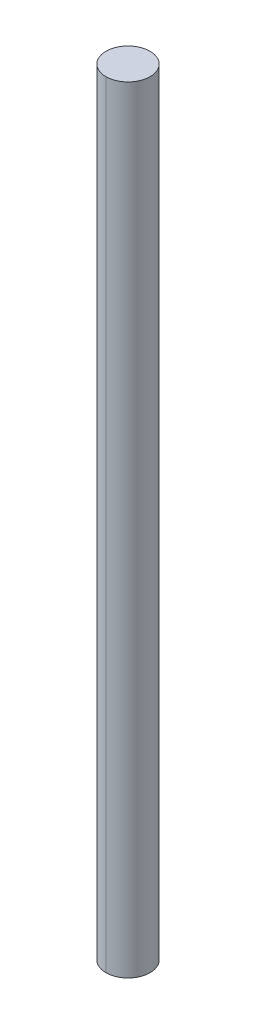
ISO-10303-21;
HEADER;
FILE_DESCRIPTION(('STEP AP214'),'2;1');
FILE_NAME('part.step','',(''),(''),'','','');
FILE_SCHEMA(('AUTOMOTIVE_DESIGN { 1 0 10303 214 1 1 1 1 }'));
ENDSEC;
DATA;
#1=APPLICATION_CONTEXT('core data for automotive mechanical design processes');
#2=APPLICATION_PROTOCOL_DEFINITION('international standard','automotive_design',2000,#1);
#3=PRODUCT_CONTEXT('',#1,'mechanical');
#4=PRODUCT('Part','Part','',(#3));
#5=PRODUCT_RELATED_PRODUCT_CATEGORY('part','',(#4));
#6=PRODUCT_DEFINITION_FORMATION('','',#4);
#7=PRODUCT_DEFINITION_CONTEXT('part definition',#1,'design');
#8=PRODUCT_DEFINITION('design','',#6,#7);
#9=PRODUCT_DEFINITION_SHAPE('','',#8);
#10=(LENGTH_UNIT() NAMED_UNIT(*) SI_UNIT(.MILLI.,.METRE.));
#11=(NAMED_UNIT(*) PLANE_ANGLE_UNIT() SI_UNIT($,.RADIAN.));
#12=(NAMED_UNIT(*) SI_UNIT($,.STERADIAN.) SOLID_ANGLE_UNIT());
#13=UNCERTAINTY_MEASURE_WITH_UNIT(LENGTH_MEASURE(1.E-05),#10,'distance_accuracy_value','');
#14=(GEOMETRIC_REPRESENTATION_CONTEXT(3) GLOBAL_UNCERTAINTY_ASSIGNED_CONTEXT((#13)) GLOBAL_UNIT_ASSIGNED_CONTEXT((#10,
#11,#12)) REPRESENTATION_CONTEXT('',''));
#15=CARTESIAN_POINT('',(0.,0.,0.));
#16=DIRECTION('',(0.,0.,1.));
#17=DIRECTION('',(1.,0.,0.));
#18=AXIS2_PLACEMENT_3D('',#15,#16,#17);
#19=CARTESIAN_POINT('',(0.,0.,0.));
#20=DIRECTION('',(0.,1.,0.));
#21=DIRECTION('',(1.,0.,0.));
#22=AXIS2_PLACEMENT_3D('',#19,#20,#21);
#23=PLANE('',#22);
#24=CARTESIAN_POINT('',(0.,0.,0.));
#25=DIRECTION('',(0.,-1.,0.));
#26=DIRECTION('',(0.,0.,-1.));
#27=AXIS2_PLACEMENT_3D('',#24,#25,#26);
#28=CIRCLE('',#27,0.225);
#29=CARTESIAN_POINT('',(0.,0.,-0.225));
#30=VERTEX_POINT('',#29);
#31=CARTESIAN_POINT('',(0.,0.,0.225));
#32=VERTEX_POINT('',#31);
#33=EDGE_CURVE('E26',#30,#32,#28,.T.);
#34=ORIENTED_EDGE('',*,*,#33,.T.);
#35=CARTESIAN_POINT('',(0.,0.,0.));
#36=DIRECTION('',(0.,-1.,0.));
#37=DIRECTION('',(0.,0.,1.));
#38=AXIS2_PLACEMENT_3D('',#35,#36,#37);
#39=CIRCLE('',#38,0.225);
#40=EDGE_CURVE('E60',#32,#30,#39,.T.);
#41=ORIENTED_EDGE('',*,*,#40,.T.);
#42=EDGE_LOOP('',(#34,#41));
#43=FACE_BOUND('',#42,.T.);
#44=ADVANCED_FACE('F16',(#43),#23,.F.);
#45=CARTESIAN_POINT('',(0.,7.92,0.));
#46=DIRECTION('',(0.,1.,0.));
#47=DIRECTION('',(1.,0.,0.));
#48=AXIS2_PLACEMENT_3D('',#45,#46,#47);
#49=PLANE('',#48);
#50=CARTESIAN_POINT('',(0.,7.92,0.));
#51=DIRECTION('',(0.,1.,0.));
#52=DIRECTION('',(0.,0.,1.));
#53=AXIS2_PLACEMENT_3D('',#50,#51,#52);
#54=CIRCLE('',#53,0.225);
#55=CARTESIAN_POINT('',(0.,7.92,0.225));
#56=VERTEX_POINT('',#55);
#57=CARTESIAN_POINT('',(0.,7.92,-0.225));
#58=VERTEX_POINT('',#57);
#59=EDGE_CURVE('E11',#56,#58,#54,.T.);
#60=ORIENTED_EDGE('',*,*,#59,.T.);
#61=CARTESIAN_POINT('',(0.,7.92,0.));
#62=DIRECTION('',(0.,1.,0.));
#63=DIRECTION('',(0.,0.,-1.));
#64=AXIS2_PLACEMENT_3D('',#61,#62,#63);
#65=CIRCLE('',#64,0.225);
#66=EDGE_CURVE('E19',#58,#56,#65,.T.);
#67=ORIENTED_EDGE('',*,*,#66,.T.);
#68=EDGE_LOOP('',(#60,#67));
#69=FACE_BOUND('',#68,.T.);
#70=ADVANCED_FACE('F52',(#69),#49,.T.);
#71=CARTESIAN_POINT('',(0.,7.92,0.));
#72=DIRECTION('',(0.,-1.,0.));
#73=DIRECTION('',(0.,0.,-1.));
#74=AXIS2_PLACEMENT_3D('',#71,#72,#73);
#75=CYLINDRICAL_SURFACE('',#74,0.225);
#76=DIRECTION('',(0.,1.,0.));
#77=VECTOR('',#76,1.);
#78=CARTESIAN_POINT('',(0.,0.,0.225));
#79=LINE('',#78,#77);
#80=EDGE_CURVE('E63',#32,#56,#79,.T.);
#81=ORIENTED_EDGE('',*,*,#80,.F.);
#82=ORIENTED_EDGE('',*,*,#33,.F.);
#83=DIRECTION('',(0.,1.,0.));
#84=VECTOR('',#83,1.);
#85=CARTESIAN_POINT('',(0.,0.,-0.225));
#86=LINE('',#85,#84);
#87=EDGE_CURVE('E55',#30,#58,#86,.T.);
#88=ORIENTED_EDGE('',*,*,#87,.T.);
#89=ORIENTED_EDGE('',*,*,#59,.F.);
#90=EDGE_LOOP('',(#81,#82,#88,#89));
#91=FACE_BOUND('',#90,.T.);
#92=ADVANCED_FACE('F56',(#91),#75,.T.);
#93=CARTESIAN_POINT('',(0.,7.92,0.));
#94=DIRECTION('',(0.,-1.,0.));
#95=DIRECTION('',(0.,0.,-1.));
#96=AXIS2_PLACEMENT_3D('',#93,#94,#95);
#97=CYLINDRICAL_SURFACE('',#96,0.225);
#98=ORIENTED_EDGE('',*,*,#66,.F.);
#99=ORIENTED_EDGE('',*,*,#87,.F.);
#100=ORIENTED_EDGE('',*,*,#40,.F.);
#101=ORIENTED_EDGE('',*,*,#80,.T.);
#102=EDGE_LOOP('',(#98,#99,#100,#101));
#103=FACE_BOUND('',#102,.T.);
#104=ADVANCED_FACE('F62',(#103),#97,.T.);
#105=CLOSED_SHELL('',(#44,#70,#92,#104));
#106=MANIFOLD_SOLID_BREP('B1',#105);
#107=ADVANCED_BREP_SHAPE_REPRESENTATION('',(#18,#106),#14);
#108=SHAPE_DEFINITION_REPRESENTATION(#9,#107);
ENDSEC;
END-ISO-10303-21;
